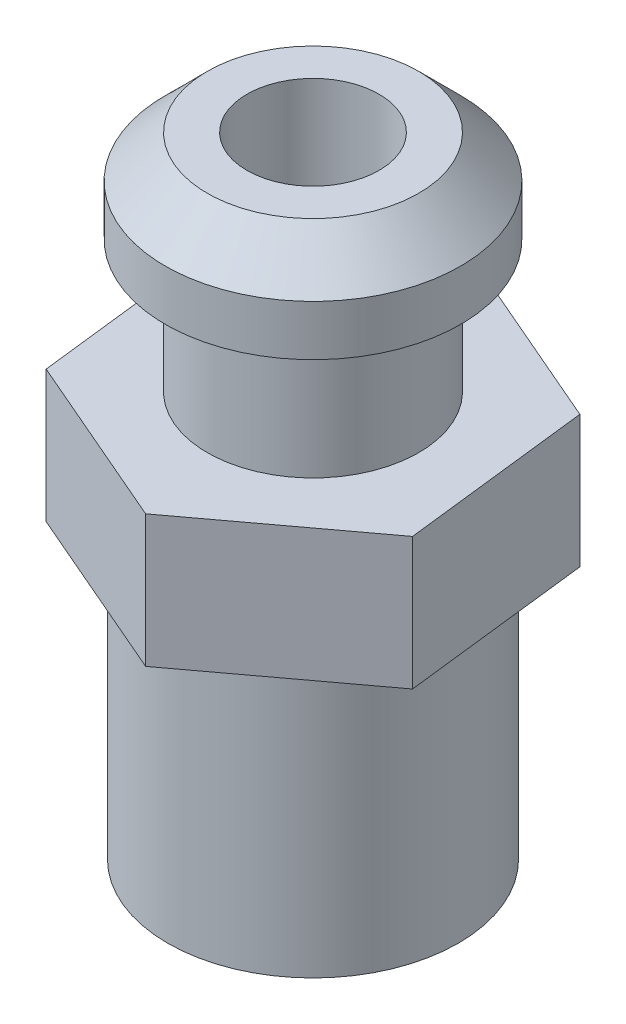
ISO-10303-21;
HEADER;
FILE_DESCRIPTION(('STEP AP214'),'2;1');
FILE_NAME('part.step','',(''),(''),'','','');
FILE_SCHEMA(('AUTOMOTIVE_DESIGN { 1 0 10303 214 1 1 1 1 }'));
ENDSEC;
DATA;
#1=APPLICATION_CONTEXT('core data for automotive mechanical design processes');
#2=APPLICATION_PROTOCOL_DEFINITION('international standard','automotive_design',2000,#1);
#3=PRODUCT_CONTEXT('',#1,'mechanical');
#4=PRODUCT('Part','Part','',(#3));
#5=PRODUCT_RELATED_PRODUCT_CATEGORY('part','',(#4));
#6=PRODUCT_DEFINITION_FORMATION('','',#4);
#7=PRODUCT_DEFINITION_CONTEXT('part definition',#1,'design');
#8=PRODUCT_DEFINITION('design','',#6,#7);
#9=PRODUCT_DEFINITION_SHAPE('','',#8);
#10=(LENGTH_UNIT() NAMED_UNIT(*) SI_UNIT(.MILLI.,.METRE.));
#11=(NAMED_UNIT(*) PLANE_ANGLE_UNIT() SI_UNIT($,.RADIAN.));
#12=(NAMED_UNIT(*) SI_UNIT($,.STERADIAN.) SOLID_ANGLE_UNIT());
#13=UNCERTAINTY_MEASURE_WITH_UNIT(LENGTH_MEASURE(1.E-05),#10,'distance_accuracy_value','');
#14=(GEOMETRIC_REPRESENTATION_CONTEXT(3) GLOBAL_UNCERTAINTY_ASSIGNED_CONTEXT((#13)) GLOBAL_UNIT_ASSIGNED_CONTEXT((#10,
#11,#12)) REPRESENTATION_CONTEXT('',''));
#15=CARTESIAN_POINT('',(0.,0.,0.));
#16=DIRECTION('',(0.,0.,1.));
#17=DIRECTION('',(1.,0.,0.));
#18=AXIS2_PLACEMENT_3D('',#15,#16,#17);
#19=CARTESIAN_POINT('',(0.,9.398,0.));
#20=DIRECTION('',(0.,-1.,0.));
#21=DIRECTION('',(0.,0.,-1.));
#22=AXIS2_PLACEMENT_3D('',#19,#20,#21);
#23=PLANE('',#22);
#24=CARTESIAN_POINT('',(0.,9.398,0.));
#25=DIRECTION('',(0.,-1.,0.));
#26=DIRECTION('',(0.,0.,-1.));
#27=AXIS2_PLACEMENT_3D('',#24,#25,#26);
#28=CIRCLE('',#27,2.032);
#29=CARTESIAN_POINT('',(0.,9.398,-2.032));
#30=VERTEX_POINT('',#29);
#31=EDGE_CURVE('E12',#30,#30,#28,.T.);
#32=ORIENTED_EDGE('',*,*,#31,.T.);
#33=EDGE_LOOP('',(#32));
#34=FACE_BOUND('',#33,.T.);
#35=DIRECTION('',(0.802257150251262,0.,-0.596978613411505));
#36=VECTOR('',#35,1.);
#37=CARTESIAN_POINT('',(0.424799860820971,9.398,3.64148025006038));
#38=LINE('',#37,#36);
#39=CARTESIAN_POINT('',(0.424799860820971,9.398,3.64148025006038));
#40=VERTEX_POINT('',#39);
#41=CARTESIAN_POINT('',(3.36601433434208,9.398,1.45285265403514));
#42=VERTEX_POINT('',#41);
#43=EDGE_CURVE('E127',#40,#42,#38,.T.);
#44=ORIENTED_EDGE('',*,*,#43,.T.);
#45=DIRECTION('',(-0.115870069604742,0.,-0.993264379191055));
#46=VECTOR('',#45,1.);
#47=CARTESIAN_POINT('',(3.36601433434208,9.398,1.45285265403514));
#48=LINE('',#47,#46);
#49=CARTESIAN_POINT('',(2.94121447352111,9.398,-2.18862759602525));
#50=VERTEX_POINT('',#49);
#51=EDGE_CURVE('E130',#42,#50,#48,.T.);
#52=ORIENTED_EDGE('',*,*,#51,.T.);
#53=DIRECTION('',(-0.918127219856004,0.,-0.39628576577955));
#54=VECTOR('',#53,1.);
#55=CARTESIAN_POINT('',(2.94121447352111,9.398,-2.18862759602525));
#56=LINE('',#55,#54);
#57=CARTESIAN_POINT('',(-0.424799860820973,9.398,-3.64148025006038));
#58=VERTEX_POINT('',#57);
#59=EDGE_CURVE('E64',#50,#58,#56,.T.);
#60=ORIENTED_EDGE('',*,*,#59,.T.);
#61=DIRECTION('',(-0.802257150251262,0.,0.596978613411505));
#62=VECTOR('',#61,1.);
#63=CARTESIAN_POINT('',(-0.424799860820973,9.398,-3.64148025006038));
#64=LINE('',#63,#62);
#65=CARTESIAN_POINT('',(-3.36601433434209,9.398,-1.45285265403513));
#66=VERTEX_POINT('',#65);
#67=EDGE_CURVE('E104',#58,#66,#64,.T.);
#68=ORIENTED_EDGE('',*,*,#67,.T.);
#69=DIRECTION('',(0.115870069604742,0.,0.993264379191055));
#70=VECTOR('',#69,1.);
#71=CARTESIAN_POINT('',(-3.36601433434209,9.398,-1.45285265403513));
#72=LINE('',#71,#70);
#73=CARTESIAN_POINT('',(-2.94121447352111,9.398,2.18862759602525));
#74=VERTEX_POINT('',#73);
#75=EDGE_CURVE('E136',#66,#74,#72,.T.);
#76=ORIENTED_EDGE('',*,*,#75,.T.);
#77=DIRECTION('',(0.918127219856004,0.,0.39628576577955));
#78=VECTOR('',#77,1.);
#79=CARTESIAN_POINT('',(-2.94121447352111,9.398,2.18862759602525));
#80=LINE('',#79,#78);
#81=EDGE_CURVE('E139',#74,#40,#80,.T.);
#82=ORIENTED_EDGE('',*,*,#81,.T.);
#83=EDGE_LOOP('',(#44,#52,#60,#68,#76,#82));
#84=FACE_BOUND('',#83,.T.);
#85=ADVANCED_FACE('F36',(#34,#84),#23,.F.);
#86=CARTESIAN_POINT('',(0.,0.,0.));
#87=DIRECTION('',(0.,-1.,0.));
#88=DIRECTION('',(0.,0.,-1.));
#89=AXIS2_PLACEMENT_3D('',#86,#87,#88);
#90=CYLINDRICAL_SURFACE('',#89,2.032);
#91=ORIENTED_EDGE('',*,*,#31,.F.);
#92=EDGE_LOOP('',(#91));
#93=FACE_BOUND('',#92,.T.);
#94=CARTESIAN_POINT('',(0.,11.938,0.));
#95=DIRECTION('',(0.,-1.,0.));
#96=DIRECTION('',(0.,0.,-1.));
#97=AXIS2_PLACEMENT_3D('',#94,#95,#96);
#98=CIRCLE('',#97,2.032);
#99=CARTESIAN_POINT('',(0.,11.938,-2.032));
#100=VERTEX_POINT('',#99);
#101=EDGE_CURVE('E49',#100,#100,#98,.T.);
#102=ORIENTED_EDGE('',*,*,#101,.T.);
#103=EDGE_LOOP('',(#102));
#104=FACE_BOUND('',#103,.T.);
#105=ADVANCED_FACE('F167',(#93,#104),#90,.T.);
#106=CARTESIAN_POINT('',(0.,11.938,0.));
#107=DIRECTION('',(0.,1.,0.));
#108=DIRECTION('',(0.,0.,1.));
#109=AXIS2_PLACEMENT_3D('',#106,#107,#108);
#110=PLANE('',#109);
#111=ORIENTED_EDGE('',*,*,#101,.F.);
#112=EDGE_LOOP('',(#111));
#113=FACE_BOUND('',#112,.T.);
#114=CARTESIAN_POINT('',(0.,11.938,0.));
#115=DIRECTION('',(0.,-1.,0.));
#116=DIRECTION('',(0.,0.,-1.));
#117=AXIS2_PLACEMENT_3D('',#114,#115,#116);
#118=CIRCLE('',#117,2.83975744436022);
#119=CARTESIAN_POINT('',(0.,11.938,-2.83975744436022));
#120=VERTEX_POINT('',#119);
#121=EDGE_CURVE('E161',#120,#120,#118,.T.);
#122=ORIENTED_EDGE('',*,*,#121,.T.);
#123=EDGE_LOOP('',(#122));
#124=FACE_BOUND('',#123,.T.);
#125=ADVANCED_FACE('F169',(#113,#124),#110,.F.);
#126=CARTESIAN_POINT('',(0.,0.,0.));
#127=DIRECTION('',(0.,-1.,0.));
#128=DIRECTION('',(0.,0.,-1.));
#129=AXIS2_PLACEMENT_3D('',#126,#127,#128);
#130=CYLINDRICAL_SURFACE('',#129,2.83975744436022);
#131=ORIENTED_EDGE('',*,*,#121,.F.);
#132=EDGE_LOOP('',(#131));
#133=FACE_BOUND('',#132,.T.);
#134=CARTESIAN_POINT('',(0.,12.9082425556398,0.));
#135=DIRECTION('',(0.,-1.,0.));
#136=DIRECTION('',(0.,0.,-1.));
#137=AXIS2_PLACEMENT_3D('',#134,#135,#136);
#138=CIRCLE('',#137,2.83975744436022);
#139=CARTESIAN_POINT('',(0.,12.9082425556398,-2.83975744436022));
#140=VERTEX_POINT('',#139);
#141=EDGE_CURVE('E158',#140,#140,#138,.T.);
#142=ORIENTED_EDGE('',*,*,#141,.T.);
#143=EDGE_LOOP('',(#142));
#144=FACE_BOUND('',#143,.T.);
#145=ADVANCED_FACE('F172',(#133,#144),#130,.T.);
#146=CARTESIAN_POINT('',(0.,13.716,0.));
#147=DIRECTION('',(0.,-1.,0.));
#148=DIRECTION('',(0.,0.,-1.));
#149=AXIS2_PLACEMENT_3D('',#146,#147,#148);
#150=CONICAL_SURFACE('',#149,2.032,0.785398163397446);
#151=ORIENTED_EDGE('',*,*,#141,.F.);
#152=EDGE_LOOP('',(#151));
#153=FACE_BOUND('',#152,.T.);
#154=CARTESIAN_POINT('',(0.,13.716,0.));
#155=DIRECTION('',(0.,-1.,0.));
#156=DIRECTION('',(0.,0.,-1.));
#157=AXIS2_PLACEMENT_3D('',#154,#155,#156);
#158=CIRCLE('',#157,2.032);
#159=CARTESIAN_POINT('',(0.,13.716,-2.032));
#160=VERTEX_POINT('',#159);
#161=EDGE_CURVE('E155',#160,#160,#158,.T.);
#162=ORIENTED_EDGE('',*,*,#161,.T.);
#163=EDGE_LOOP('',(#162));
#164=FACE_BOUND('',#163,.T.);
#165=ADVANCED_FACE('F178',(#153,#164),#150,.T.);
#166=CARTESIAN_POINT('',(0.,13.716,0.));
#167=DIRECTION('',(0.,-1.,0.));
#168=DIRECTION('',(0.,0.,-1.));
#169=AXIS2_PLACEMENT_3D('',#166,#167,#168);
#170=PLANE('',#169);
#171=CARTESIAN_POINT('',(0.,13.716,0.));
#172=DIRECTION('',(0.,1.,0.));
#173=DIRECTION('',(0.,0.,1.));
#174=AXIS2_PLACEMENT_3D('',#171,#172,#173);
#175=CIRCLE('',#174,1.27);
#176=CARTESIAN_POINT('',(0.,13.716,1.27));
#177=VERTEX_POINT('',#176);
#178=EDGE_CURVE('E215',#177,#177,#175,.T.);
#179=ORIENTED_EDGE('',*,*,#178,.F.);
#180=EDGE_LOOP('',(#179));
#181=FACE_BOUND('',#180,.T.);
#182=ORIENTED_EDGE('',*,*,#161,.F.);
#183=EDGE_LOOP('',(#182));
#184=FACE_BOUND('',#183,.T.);
#185=ADVANCED_FACE('F184',(#181,#184),#170,.F.);
#186=CARTESIAN_POINT('',(0.424799860820971,6.858,3.64148025006038));
#187=DIRECTION('',(0.596978613411505,0.,0.802257150251262));
#188=DIRECTION('',(0.802257150251262,0.,-0.596978613411505));
#189=AXIS2_PLACEMENT_3D('',#186,#187,#188);
#190=PLANE('',#189);
#191=ORIENTED_EDGE('',*,*,#43,.F.);
#192=DIRECTION('',(0.,1.,0.));
#193=VECTOR('',#192,1.);
#194=CARTESIAN_POINT('',(0.424799860820971,6.858,3.64148025006038));
#195=LINE('',#194,#193);
#196=CARTESIAN_POINT('',(0.424799860820971,6.858,3.64148025006038));
#197=VERTEX_POINT('',#196);
#198=EDGE_CURVE('E142',#197,#40,#195,.T.);
#199=ORIENTED_EDGE('',*,*,#198,.F.);
#200=DIRECTION('',(0.802257150251262,0.,-0.596978613411505));
#201=VECTOR('',#200,1.);
#202=CARTESIAN_POINT('',(0.424799860820971,6.858,3.64148025006038));
#203=LINE('',#202,#201);
#204=CARTESIAN_POINT('',(3.36601433434208,6.858,1.45285265403514));
#205=VERTEX_POINT('',#204);
#206=EDGE_CURVE('E56',#197,#205,#203,.T.);
#207=ORIENTED_EDGE('',*,*,#206,.T.);
#208=DIRECTION('',(0.,1.,0.));
#209=VECTOR('',#208,1.);
#210=CARTESIAN_POINT('',(3.36601433434208,6.858,1.45285265403514));
#211=LINE('',#210,#209);
#212=EDGE_CURVE('E126',#205,#42,#211,.T.);
#213=ORIENTED_EDGE('',*,*,#212,.T.);
#214=EDGE_LOOP('',(#191,#199,#207,#213));
#215=FACE_BOUND('',#214,.T.);
#216=ADVANCED_FACE('F189',(#215),#190,.T.);
#217=CARTESIAN_POINT('',(-2.94121447352111,6.858,2.18862759602525));
#218=DIRECTION('',(-0.39628576577955,0.,0.918127219856004));
#219=DIRECTION('',(0.918127219856004,0.,0.39628576577955));
#220=AXIS2_PLACEMENT_3D('',#217,#218,#219);
#221=PLANE('',#220);
#222=ORIENTED_EDGE('',*,*,#81,.F.);
#223=DIRECTION('',(0.,1.,0.));
#224=VECTOR('',#223,1.);
#225=CARTESIAN_POINT('',(-2.94121447352111,6.858,2.18862759602525));
#226=LINE('',#225,#224);
#227=CARTESIAN_POINT('',(-2.94121447352111,6.858,2.18862759602525));
#228=VERTEX_POINT('',#227);
#229=EDGE_CURVE('E145',#228,#74,#226,.T.);
#230=ORIENTED_EDGE('',*,*,#229,.F.);
#231=DIRECTION('',(0.918127219856004,0.,0.39628576577955));
#232=VECTOR('',#231,1.);
#233=CARTESIAN_POINT('',(-2.94121447352111,6.858,2.18862759602525));
#234=LINE('',#233,#232);
#235=EDGE_CURVE('E120',#228,#197,#234,.T.);
#236=ORIENTED_EDGE('',*,*,#235,.T.);
#237=ORIENTED_EDGE('',*,*,#198,.T.);
#238=EDGE_LOOP('',(#222,#230,#236,#237));
#239=FACE_BOUND('',#238,.T.);
#240=ADVANCED_FACE('F195',(#239),#221,.T.);
#241=CARTESIAN_POINT('',(-3.36601433434209,6.858,-1.45285265403513));
#242=DIRECTION('',(-0.993264379191055,0.,0.115870069604742));
#243=DIRECTION('',(0.115870069604742,0.,0.993264379191055));
#244=AXIS2_PLACEMENT_3D('',#241,#242,#243);
#245=PLANE('',#244);
#246=ORIENTED_EDGE('',*,*,#75,.F.);
#247=DIRECTION('',(0.,1.,0.));
#248=VECTOR('',#247,1.);
#249=CARTESIAN_POINT('',(-3.36601433434209,6.858,-1.45285265403513));
#250=LINE('',#249,#248);
#251=CARTESIAN_POINT('',(-3.36601433434209,6.858,-1.45285265403513));
#252=VERTEX_POINT('',#251);
#253=EDGE_CURVE('E105',#252,#66,#250,.T.);
#254=ORIENTED_EDGE('',*,*,#253,.F.);
#255=DIRECTION('',(0.115870069604742,0.,0.993264379191055));
#256=VECTOR('',#255,1.);
#257=CARTESIAN_POINT('',(-3.36601433434209,6.858,-1.45285265403513));
#258=LINE('',#257,#256);
#259=EDGE_CURVE('E118',#252,#228,#258,.T.);
#260=ORIENTED_EDGE('',*,*,#259,.T.);
#261=ORIENTED_EDGE('',*,*,#229,.T.);
#262=EDGE_LOOP('',(#246,#254,#260,#261));
#263=FACE_BOUND('',#262,.T.);
#264=ADVANCED_FACE('F243',(#263),#245,.T.);
#265=CARTESIAN_POINT('',(-0.424799860820973,6.858,-3.64148025006038));
#266=DIRECTION('',(-0.596978613411505,0.,-0.802257150251262));
#267=DIRECTION('',(-0.802257150251262,0.,0.596978613411505));
#268=AXIS2_PLACEMENT_3D('',#265,#266,#267);
#269=PLANE('',#268);
#270=ORIENTED_EDGE('',*,*,#67,.F.);
#271=DIRECTION('',(0.,1.,0.));
#272=VECTOR('',#271,1.);
#273=CARTESIAN_POINT('',(-0.424799860820973,6.858,-3.64148025006038));
#274=LINE('',#273,#272);
#275=CARTESIAN_POINT('',(-0.424799860820973,6.858,-3.64148025006038));
#276=VERTEX_POINT('',#275);
#277=EDGE_CURVE('E97',#276,#58,#274,.T.);
#278=ORIENTED_EDGE('',*,*,#277,.F.);
#279=DIRECTION('',(-0.802257150251262,0.,0.596978613411505));
#280=VECTOR('',#279,1.);
#281=CARTESIAN_POINT('',(-0.424799860820973,6.858,-3.64148025006038));
#282=LINE('',#281,#280);
#283=EDGE_CURVE('E101',#276,#252,#282,.T.);
#284=ORIENTED_EDGE('',*,*,#283,.T.);
#285=ORIENTED_EDGE('',*,*,#253,.T.);
#286=EDGE_LOOP('',(#270,#278,#284,#285));
#287=FACE_BOUND('',#286,.T.);
#288=ADVANCED_FACE('F99',(#287),#269,.T.);
#289=CARTESIAN_POINT('',(2.94121447352111,6.858,-2.18862759602525));
#290=DIRECTION('',(0.39628576577955,0.,-0.918127219856004));
#291=DIRECTION('',(-0.918127219856004,0.,-0.39628576577955));
#292=AXIS2_PLACEMENT_3D('',#289,#290,#291);
#293=PLANE('',#292);
#294=ORIENTED_EDGE('',*,*,#59,.F.);
#295=DIRECTION('',(0.,1.,0.));
#296=VECTOR('',#295,1.);
#297=CARTESIAN_POINT('',(2.94121447352111,6.858,-2.18862759602525));
#298=LINE('',#297,#296);
#299=CARTESIAN_POINT('',(2.94121447352111,6.858,-2.18862759602525));
#300=VERTEX_POINT('',#299);
#301=EDGE_CURVE('E106',#300,#50,#298,.T.);
#302=ORIENTED_EDGE('',*,*,#301,.F.);
#303=DIRECTION('',(-0.918127219856004,0.,-0.39628576577955));
#304=VECTOR('',#303,1.);
#305=CARTESIAN_POINT('',(2.94121447352111,6.858,-2.18862759602525));
#306=LINE('',#305,#304);
#307=EDGE_CURVE('E109',#300,#276,#306,.T.);
#308=ORIENTED_EDGE('',*,*,#307,.T.);
#309=ORIENTED_EDGE('',*,*,#277,.T.);
#310=EDGE_LOOP('',(#294,#302,#308,#309));
#311=FACE_BOUND('',#310,.T.);
#312=ADVANCED_FACE('F110',(#311),#293,.T.);
#313=CARTESIAN_POINT('',(3.36601433434208,6.858,1.45285265403514));
#314=DIRECTION('',(0.993264379191055,0.,-0.115870069604742));
#315=DIRECTION('',(-0.115870069604742,0.,-0.993264379191055));
#316=AXIS2_PLACEMENT_3D('',#313,#314,#315);
#317=PLANE('',#316);
#318=ORIENTED_EDGE('',*,*,#51,.F.);
#319=ORIENTED_EDGE('',*,*,#212,.F.);
#320=DIRECTION('',(-0.115870069604742,0.,-0.993264379191055));
#321=VECTOR('',#320,1.);
#322=CARTESIAN_POINT('',(3.36601433434208,6.858,1.45285265403514));
#323=LINE('',#322,#321);
#324=EDGE_CURVE('E114',#205,#300,#323,.T.);
#325=ORIENTED_EDGE('',*,*,#324,.T.);
#326=ORIENTED_EDGE('',*,*,#301,.T.);
#327=EDGE_LOOP('',(#318,#319,#325,#326));
#328=FACE_BOUND('',#327,.T.);
#329=ADVANCED_FACE('F212',(#328),#317,.T.);
#330=CARTESIAN_POINT('',(0.,0.,0.));
#331=DIRECTION('',(0.,1.,0.));
#332=DIRECTION('',(0.,0.,1.));
#333=AXIS2_PLACEMENT_3D('',#330,#331,#332);
#334=CONICAL_SURFACE('',#333,0.,1.0471975511966);
#335=CARTESIAN_POINT('',(0.,1.61311665211581,0.));
#336=DIRECTION('',(0.,-1.,0.));
#337=DIRECTION('',(0.,0.,-1.));
#338=AXIS2_PLACEMENT_3D('',#335,#336,#337);
#339=CIRCLE('',#338,2.794);
#340=CARTESIAN_POINT('',(0.,1.61311665211581,-2.794));
#341=VERTEX_POINT('',#340);
#342=EDGE_CURVE('E152',#341,#341,#339,.T.);
#343=ORIENTED_EDGE('',*,*,#342,.T.);
#344=EDGE_LOOP('',(#343));
#345=FACE_BOUND('',#344,.T.);
#346=CARTESIAN_POINT('',(0.,0.,0.));
#347=VERTEX_POINT('',#346);
#348=VERTEX_LOOP('',#347);
#349=FACE_BOUND('',#348,.T.);
#350=ADVANCED_FACE('F253',(#345,#349),#334,.T.);
#351=CARTESIAN_POINT('',(0.,0.,0.));
#352=DIRECTION('',(0.,-1.,0.));
#353=DIRECTION('',(0.,0.,-1.));
#354=AXIS2_PLACEMENT_3D('',#351,#352,#353);
#355=CYLINDRICAL_SURFACE('',#354,2.794);
#356=CARTESIAN_POINT('',(-2.72088423127483,3.79195235957136,-0.635));
#357=CARTESIAN_POINT('',(-2.72088493970861,3.82712277206635,-0.63499883982767));
#358=CARTESIAN_POINT('',(-2.72157358896207,3.86230682446334,-0.632068109332914));
#359=CARTESIAN_POINT('',(-2.72424820928516,3.93167180961575,-0.620436961405991));
#360=CARTESIAN_POINT('',(-2.72623507013706,3.96585203755716,-0.611732586709162));
#361=CARTESIAN_POINT('',(-2.73126973326066,4.03219598840524,-0.588844492556458));
#362=CARTESIAN_POINT('',(-2.73431631785342,4.06436197593782,-0.574667059890661));
#363=CARTESIAN_POINT('',(-2.74112567747865,4.12586035308853,-0.541253616476163));
#364=CARTESIAN_POINT('',(-2.74488844975095,4.15519275362662,-0.522017625222984));
#365=CARTESIAN_POINT('',(-2.75278286224879,4.21072609171308,-0.478659261211028));
#366=CARTESIAN_POINT('',(-2.75691953604857,4.23686784779577,-0.454461991811337));
#367=CARTESIAN_POINT('',(-2.76505169331145,4.28475871586895,-0.402029538985921));
#368=CARTESIAN_POINT('',(-2.76904716522579,4.30650746924349,-0.373794026225574));
#369=CARTESIAN_POINT('',(-2.77650179015189,4.3452311738325,-0.313687514062456));
#370=CARTESIAN_POINT('',(-2.77995431050126,4.36214888248076,-0.281778742577742));
#371=CARTESIAN_POINT('',(-2.7858770200949,4.39035944784827,-0.215479339331659));
#372=CARTESIAN_POINT('',(-2.7883473285194,4.40165298703847,-0.18108900927783));
#373=CARTESIAN_POINT('',(-2.79199170349128,4.41810759589156,-0.111418520849939));
#374=CARTESIAN_POINT('',(-2.79318693788915,4.42336892182016,-0.0761631668259644));
#375=CARTESIAN_POINT('',(-2.79421994569391,4.42792353697398,-0.00525131259642495));
#376=CARTESIAN_POINT('',(-2.79405788624394,4.4272175610389,0.0304051376763454));
#377=CARTESIAN_POINT('',(-2.79241063430897,4.4199316145137,0.100414803211659));
#378=CARTESIAN_POINT('',(-2.79094979300767,4.41345974545586,0.134779926432631));
#379=CARTESIAN_POINT('',(-2.78689701724004,4.39499837733989,0.201923149914224));
#380=CARTESIAN_POINT('',(-2.78430502904167,4.38300861616785,0.234701174701875));
#381=CARTESIAN_POINT('',(-2.7782425304481,4.35375834546511,0.298035838714238));
#382=CARTESIAN_POINT('',(-2.77476533603011,4.33645751878447,0.32857319197424));
#383=CARTESIAN_POINT('',(-2.76731265551087,4.29710641353456,0.386350255889804));
#384=CARTESIAN_POINT('',(-2.76333709655407,4.27505544020554,0.413589483247849));
#385=CARTESIAN_POINT('',(-2.75521854508754,4.22624373999288,0.464640560245481));
#386=CARTESIAN_POINT('',(-2.75107379729736,4.19938842282806,0.488361774045336));
#387=CARTESIAN_POINT('',(-2.7431670827424,4.14203781237405,0.530981716985757));
#388=CARTESIAN_POINT('',(-2.73940512809999,4.11154240387613,0.549880293430617));
#389=CARTESIAN_POINT('',(-2.73268482650064,4.04762266659148,0.5823632939397));
#390=CARTESIAN_POINT('',(-2.72972926319851,4.01418870607573,0.595929379561286));
#391=CARTESIAN_POINT('',(-2.72499407315904,3.94543222692157,0.617222435680656));
#392=CARTESIAN_POINT('',(-2.72321424332246,3.91011003560115,0.624950414701232));
#393=CARTESIAN_POINT('',(-2.72107379128413,3.83941118066525,0.634204777291174));
#394=CARTESIAN_POINT('',(-2.72068285178382,3.80405275883667,0.63586366401332));
#395=CARTESIAN_POINT('',(-2.72128246672738,3.73356456470246,0.633292542698174));
#396=CARTESIAN_POINT('',(-2.7222729180468,3.69843477552547,0.629062974249595));
#397=CARTESIAN_POINT('',(-2.72549497403779,3.62987031294403,0.614950300860761));
#398=CARTESIAN_POINT('',(-2.72771031069875,3.59641956120268,0.605141250336459));
#399=CARTESIAN_POINT('',(-2.73311764859761,3.53163649909395,0.580228734222567));
#400=CARTESIAN_POINT('',(-2.73630974935129,3.50030440497938,0.565124729143564));
#401=CARTESIAN_POINT('',(-2.74337682805057,3.44007776765537,0.529762964081296));
#402=CARTESIAN_POINT('',(-2.74726221354449,3.41123202905497,0.509424205658762));
#403=CARTESIAN_POINT('',(-2.75525114292535,3.35731434054687,0.46427531776606));
#404=CARTESIAN_POINT('',(-2.7593547161215,3.33224289938361,0.439464586499086));
#405=CARTESIAN_POINT('',(-2.76741832661402,3.28606536067534,0.385474184122045));
#406=CARTESIAN_POINT('',(-2.77137376771442,3.26504995269228,0.356216141319725));
#407=CARTESIAN_POINT('',(-2.77860836219836,3.22823217273788,0.294508345776897));
#408=CARTESIAN_POINT('',(-2.7818875484112,3.21242954768571,0.262058748085839));
#409=CARTESIAN_POINT('',(-2.78738090884142,3.18660929515705,0.195098682526241));
#410=CARTESIAN_POINT('',(-2.78960210096306,3.17655345641203,0.160603551352808));
#411=CARTESIAN_POINT('',(-2.79275965676867,3.16239391654337,0.0903570159029494));
#412=CARTESIAN_POINT('',(-2.79369622296974,3.15828927722662,0.0546058105541577));
#413=CARTESIAN_POINT('',(-2.79417239749324,3.1561936320637,-0.016279531253053));
#414=CARTESIAN_POINT('',(-2.79374284756174,3.15806765363085,-0.051409537119443));
#415=CARTESIAN_POINT('',(-2.79160173609245,3.16757234053559,-0.120839938591257));
#416=CARTESIAN_POINT('',(-2.78989020126621,3.17520288592974,-0.155140351466785));
#417=CARTESIAN_POINT('',(-2.78538037859106,3.19593720393107,-0.221823796691584));
#418=CARTESIAN_POINT('',(-2.78258617104824,3.20902044062726,-0.254213508041373));
#419=CARTESIAN_POINT('',(-2.77620823771223,3.2402692431937,-0.316355262304507));
#420=CARTESIAN_POINT('',(-2.7726244288704,3.25843534372348,-0.346107027302071));
#421=CARTESIAN_POINT('',(-2.76496615239643,3.29976689859122,-0.402782100922167));
#422=CARTESIAN_POINT('',(-2.76088319524307,3.32302642783042,-0.42963566129285));
#423=CARTESIAN_POINT('',(-2.75273043547544,3.37369664802482,-0.479104528145644));
#424=CARTESIAN_POINT('',(-2.74866063631012,3.40110834942781,-0.501718799974233));
#425=CARTESIAN_POINT('',(-2.74092795161732,3.45978944600804,-0.542389078301808));
#426=CARTESIAN_POINT('',(-2.73727192384664,3.49110960666542,-0.560373224481109));
#427=CARTESIAN_POINT('',(-2.7308683610214,3.55640516781983,-0.590793935470075));
#428=CARTESIAN_POINT('',(-2.72812008501163,3.59037837461037,-0.603235027723795));
#429=CARTESIAN_POINT('',(-2.72433121387195,3.65229502076372,-0.62008997257176));
#430=CARTESIAN_POINT('',(-2.72304746265897,3.67991198740303,-0.625670143875215));
#431=CARTESIAN_POINT('',(-2.721323711887,3.73566719701302,-0.633125516416713));
#432=CARTESIAN_POINT('',(-2.72088366431389,3.76380541022818,-0.635000928488166));
#433=CARTESIAN_POINT('',(-2.72088423127483,3.79195235957136,-0.635));
#434=B_SPLINE_CURVE_WITH_KNOTS('',3,(#356,#357,#358,#359,#360,#361,#362,#363,#364,#365,#366,
#367,#368,#369,#370,#371,#372,#373,#374,#375,#376,#377,#378,#379,#380,#381,#382,#383,#384,#385,
#386,#387,#388,#389,#390,#391,#392,#393,#394,#395,#396,#397,#398,#399,#400,#401,#402,#403,#404,
#405,#406,#407,#408,#409,#410,#411,#412,#413,#414,#415,#416,#417,#418,#419,#420,#421,#422,#423,
#424,#425,#426,#427,#428,#429,#430,#431,#432,#433),.UNSPECIFIED.,.T.,.F.,(4,2,2,2,2,2,2,2,2,2,2,
2,2,2,2,2,2,2,2,2,2,2,2,2,2,2,2,2,2,2,2,2,2,2,2,2,2,2,4),(0.,0.10540802978821,0.210888381160002,
0.316247928208334,0.421607069210298,0.528692458650819,0.635786586311045,0.744101480405102,
0.852403227706189,0.95887763056664,1.06533892189351,1.16984527691482,1.27435659676625,
1.37968176394532,1.48502234652853,1.59272697732081,1.70043501786454,1.80851029194074,
1.91656689192885,2.02224977876495,2.12792477651778,2.2322288661657,2.33654358618142,
2.44258114721422,2.54863298847091,2.65683473197218,2.76503122150087,2.87249966551402,
2.97995116552793,3.08499418011738,3.19003500608175,3.29468375225201,3.39934351042262,
3.50612968122442,3.61294188074486,3.72132354680674,3.82961652610215,3.9139795779503,
3.99833782865989),.UNSPECIFIED.);
#435=CARTESIAN_POINT('',(-2.72088423127483,3.79195235957136,-0.635));
#436=VERTEX_POINT('',#435);
#437=EDGE_CURVE('E218',#436,#436,#434,.T.);
#438=ORIENTED_EDGE('',*,*,#437,.T.);
#439=EDGE_LOOP('',(#438));
#440=FACE_BOUND('',#439,.T.);
#441=ORIENTED_EDGE('',*,*,#342,.F.);
#442=EDGE_LOOP('',(#441));
#443=FACE_BOUND('',#442,.T.);
#444=CARTESIAN_POINT('',(0.,6.858,0.));
#445=DIRECTION('',(0.,-1.,0.));
#446=DIRECTION('',(0.,0.,-1.));
#447=AXIS2_PLACEMENT_3D('',#444,#445,#446);
#448=CIRCLE('',#447,2.794);
#449=CARTESIAN_POINT('',(0.,6.858,-2.794));
#450=VERTEX_POINT('',#449);
#451=EDGE_CURVE('E144',#450,#450,#448,.T.);
#452=ORIENTED_EDGE('',*,*,#451,.T.);
#453=EDGE_LOOP('',(#452));
#454=FACE_BOUND('',#453,.T.);
#455=ADVANCED_FACE('F225',(#440,#443,#454),#355,.T.);
#456=CARTESIAN_POINT('',(0.,6.858,0.));
#457=DIRECTION('',(0.,1.,0.));
#458=DIRECTION('',(0.,0.,1.));
#459=AXIS2_PLACEMENT_3D('',#456,#457,#458);
#460=PLANE('',#459);
#461=ORIENTED_EDGE('',*,*,#451,.F.);
#462=EDGE_LOOP('',(#461));
#463=FACE_BOUND('',#462,.T.);
#464=ORIENTED_EDGE('',*,*,#206,.F.);
#465=ORIENTED_EDGE('',*,*,#235,.F.);
#466=ORIENTED_EDGE('',*,*,#259,.F.);
#467=ORIENTED_EDGE('',*,*,#283,.F.);
#468=ORIENTED_EDGE('',*,*,#307,.F.);
#469=ORIENTED_EDGE('',*,*,#324,.F.);
#470=EDGE_LOOP('',(#464,#465,#466,#467,#468,#469));
#471=FACE_BOUND('',#470,.T.);
#472=ADVANCED_FACE('F38',(#463,#471),#460,.F.);
#473=CARTESIAN_POINT('',(0.,2.286,0.));
#474=DIRECTION('',(0.,1.,0.));
#475=DIRECTION('',(0.,0.,1.));
#476=AXIS2_PLACEMENT_3D('',#473,#474,#475);
#477=CYLINDRICAL_SURFACE('',#476,1.27);
#478=CARTESIAN_POINT('',(-1.09985226280624,3.79195235957136,-0.635));
#479=CARTESIAN_POINT('',(-1.09985514552572,3.75886390136737,-0.634997690552328));
#480=CARTESIAN_POINT('',(-1.10136813754225,3.72573366325295,-0.632396481415593));
#481=CARTESIAN_POINT('',(-1.10720102697053,3.66049004650137,-0.622124238285264));
#482=CARTESIAN_POINT('',(-1.1115268222528,3.62837895351879,-0.614442550991904));
#483=CARTESIAN_POINT('',(-1.12235835094428,3.56624055271296,-0.594423467424381));
#484=CARTESIAN_POINT('',(-1.12885247605515,3.53620315525063,-0.582110819833519));
#485=CARTESIAN_POINT('',(-1.14327092158705,3.47862799130344,-0.553254878613996));
#486=CARTESIAN_POINT('',(-1.15119531937301,3.4510903601547,-0.536711356112716));
#487=CARTESIAN_POINT('',(-1.16838011851475,3.39678822193734,-0.498263253237108));
#488=CARTESIAN_POINT('',(-1.177696804101,3.37027480841866,-0.476029042951295));
#489=CARTESIAN_POINT('',(-1.19616209068923,3.3211580329331,-0.427516167835187));
#490=CARTESIAN_POINT('',(-1.20531060582844,3.29855662133082,-0.401235497871756));
#491=CARTESIAN_POINT('',(-1.22314637865123,3.25641421859259,-0.343210872768237));
#492=CARTESIAN_POINT('',(-1.2317609757554,3.23718221698056,-0.311218065022985));
#493=CARTESIAN_POINT('',(-1.24682730123201,3.2044879177603,-0.243939711890685));
#494=CARTESIAN_POINT('',(-1.25328039401676,3.19102197892426,-0.208656261717729));
#495=CARTESIAN_POINT('',(-1.26289092890091,3.17123689964516,-0.138458539392995));
#496=CARTESIAN_POINT('',(-1.26625019940266,3.16447741033559,-0.103696636960399));
#497=CARTESIAN_POINT('',(-1.27004815742253,3.15684687421271,-0.0333823492231334));
#498=CARTESIAN_POINT('',(-1.27048861208215,3.15597226450608,0.00216954471077412));
#499=CARTESIAN_POINT('',(-1.26849493516946,3.15996649754253,0.0697436530090814));
#500=CARTESIAN_POINT('',(-1.26630744891522,3.16434249942733,0.101803961477263));
#501=CARTESIAN_POINT('',(-1.2596764573994,3.17783169545082,0.164664245168135));
#502=CARTESIAN_POINT('',(-1.2552327833216,3.18694524407126,0.195464125894643));
#503=CARTESIAN_POINT('',(-1.24441955387661,3.20970978903839,0.255466463646667));
#504=CARTESIAN_POINT('',(-1.23802420371041,3.22342181843562,0.284640923932138));
#505=CARTESIAN_POINT('',(-1.22388405201546,3.25490962885931,0.340345268960964));
#506=CARTESIAN_POINT('',(-1.21613876760002,3.27268686476835,0.36687420201254));
#507=CARTESIAN_POINT('',(-1.19916190443511,3.31373090779482,0.419210274670354));
#508=CARTESIAN_POINT('',(-1.18985903758841,3.33735778255837,0.444712137643644));
#509=CARTESIAN_POINT('',(-1.17128506272625,3.38846683490202,0.491556275139091));
#510=CARTESIAN_POINT('',(-1.16201398448674,3.41595195096539,0.512895349349637));
#511=CARTESIAN_POINT('',(-1.14391539118728,3.47613396176065,0.552135887497804));
#512=CARTESIAN_POINT('',(-1.13515343194099,3.50905098421078,0.569732995011063));
#513=CARTESIAN_POINT('',(-1.11998410926896,3.57791778088432,0.599007636755782));
#514=CARTESIAN_POINT('',(-1.11357429079253,3.61386434453751,0.610691347963915));
#515=CARTESIAN_POINT('',(-1.10454843743817,3.68477357423593,0.626859434000901));
#516=CARTESIAN_POINT('',(-1.10167201463795,3.71958847016401,0.631840952546185));
#517=CARTESIAN_POINT('',(-1.09929878794622,3.78966721143436,0.635963261098256));
#518=CARTESIAN_POINT('',(-1.09979959674713,3.82493072206242,0.635108176895042));
#519=CARTESIAN_POINT('',(-1.10384803703271,3.89079259786885,0.628037887523419));
#520=CARTESIAN_POINT('',(-1.10705638066725,3.92147931102489,0.622419263612417));
#521=CARTESIAN_POINT('',(-1.11565703685102,3.98141590385342,0.606867140741601));
#522=CARTESIAN_POINT('',(-1.12105005663196,4.01066531479545,0.596932244425995));
#523=CARTESIAN_POINT('',(-1.13370501020582,4.06843855469457,0.572546218764103));
#524=CARTESIAN_POINT('',(-1.14104193459345,4.09686603527336,0.55790723044488));
#525=CARTESIAN_POINT('',(-1.15669135880754,4.15102534699862,0.524692285650036));
#526=CARTESIAN_POINT('',(-1.16500435880519,4.17675578320229,0.506114306750957));
#527=CARTESIAN_POINT('',(-1.18292879019773,4.22818387694881,0.462811601171272));
#528=CARTESIAN_POINT('',(-1.19257180302974,4.25346855027707,0.437607247920004));
#529=CARTESIAN_POINT('',(-1.21116239210962,4.29957913069729,0.383161854577913));
#530=CARTESIAN_POINT('',(-1.22010973279895,4.32040353166775,0.353919456406145));
#531=CARTESIAN_POINT('',(-1.23660764673758,4.35746667554967,0.291169955224811));
#532=CARTESIAN_POINT('',(-1.24411512461739,4.37356988963529,0.257570666959561));
#533=CARTESIAN_POINT('',(-1.25655930399156,4.3997349285208,0.187656701547087));
#534=CARTESIAN_POINT('',(-1.26149826234497,4.40980205818896,0.151344440384032));
#535=CARTESIAN_POINT('',(-1.26788867695496,4.42274139782227,0.0806320982798148));
#536=CARTESIAN_POINT('',(-1.26961854221701,4.42618901075269,0.0463622668450401));
#537=CARTESIAN_POINT('',(-1.27026752788208,4.4274878331349,-0.0223050010790144));
#538=CARTESIAN_POINT('',(-1.26918763222475,4.42534100168382,-0.0567023886873801));
#539=CARTESIAN_POINT('',(-1.26450070212081,4.41589294125614,-0.122261625121388));
#540=CARTESIAN_POINT('',(-1.26106488114174,4.40894068029274,-0.153487321810152));
#541=CARTESIAN_POINT('',(-1.25216979476274,4.39054971501397,-0.214278179636597));
#542=CARTESIAN_POINT('',(-1.24671023919325,4.37911036731202,-0.243843101946748));
#543=CARTESIAN_POINT('',(-1.23396966025056,4.35156068144597,-0.301893862965502));
#544=CARTESIAN_POINT('',(-1.22662071921237,4.33527148933438,-0.33027946561453));
#545=CARTESIAN_POINT('',(-1.21086964545059,4.29870907347586,-0.384031897551906));
#546=CARTESIAN_POINT('',(-1.20246702964559,4.27843401988291,-0.409397331708466));
#547=CARTESIAN_POINT('',(-1.18445667493909,4.23213617629194,-0.459050392639626));
#548=CARTESIAN_POINT('',(-1.17481222372428,4.20574218002334,-0.482979529682438));
#549=CARTESIAN_POINT('',(-1.15610053363411,4.14917115165395,-0.526201187495619));
#550=CARTESIAN_POINT('',(-1.14703381058785,4.11899080832038,-0.545489606256388));
#551=CARTESIAN_POINT('',(-1.13029749368622,4.05443808899245,-0.579393735663891));
#552=CARTESIAN_POINT('',(-1.12268110652732,4.01996337730461,-0.593842516885197));
#553=CARTESIAN_POINT('',(-1.11040009268503,3.9485862828156,-0.616507980536572));
#554=CARTESIAN_POINT('',(-1.10572560253791,3.9116924751118,-0.624745506396345));
#555=CARTESIAN_POINT('',(-1.10191088102137,3.86065595873234,-0.631423049993903));
#556=CARTESIAN_POINT('',(-1.10114161918271,3.8469637466287,-0.632762326652045));
#557=CARTESIAN_POINT('',(-1.10011169288721,3.81950089433813,-0.634551312232127));
#558=CARTESIAN_POINT('',(-1.09985106245444,3.80573024896633,-0.635000961643918));
#559=CARTESIAN_POINT('',(-1.09985226280624,3.79195235957136,-0.635));
#560=B_SPLINE_CURVE_WITH_KNOTS('',3,(#478,#479,#480,#481,#482,#483,#484,#485,#486,#487,#488,
#489,#490,#491,#492,#493,#494,#495,#496,#497,#498,#499,#500,#501,#502,#503,#504,#505,#506,#507,
#508,#509,#510,#511,#512,#513,#514,#515,#516,#517,#518,#519,#520,#521,#522,#523,#524,#525,#526,
#527,#528,#529,#530,#531,#532,#533,#534,#535,#536,#537,#538,#539,#540,#541,#542,#543,#544,#545,
#546,#547,#548,#549,#550,#551,#552,#553,#554,#555,#556,#557,#558,#559),.UNSPECIFIED.,.T.,.F.,(4,
2,2,2,2,2,2,2,2,2,2,2,2,2,2,2,2,2,2,2,2,2,2,2,2,2,2,2,2,2,2,2,2,2,2,2,2,2,2,2,4),(0.,
0.0992073978476442,0.198623486943751,0.297515658408492,0.39641318065767,0.503467568436379,
0.610575176385756,0.724902615716148,0.839157751220708,0.945283129546389,1.05134425040635,
1.14818221902682,1.24502743448584,1.34321254554278,1.44143285087423,1.54893766575126,
1.65652480636158,1.770944144982,1.88524371624433,1.99048554692425,2.09565299174617,
2.18931606474256,2.283009482969,2.38104233217866,2.4791256374973,2.58957282173689,
2.70005724261158,2.81345755197233,2.9267580517857,3.02966291697324,3.13253175114172,
3.22862209793398,3.32472622780128,3.42494076706865,3.52520142113957,3.63544003574793,
3.74577573706673,3.85959825639514,3.97303709456753,4.01434385842671,4.05565338534033),.UNSPECIFIED.);
#561=CARTESIAN_POINT('',(-1.09985226280624,3.79195235957136,-0.635));
#562=VERTEX_POINT('',#561);
#563=EDGE_CURVE('E40',#562,#562,#560,.T.);
#564=ORIENTED_EDGE('',*,*,#563,.T.);
#565=EDGE_LOOP('',(#564));
#566=FACE_BOUND('',#565,.T.);
#567=CARTESIAN_POINT('',(0.,2.286,0.));
#568=DIRECTION('',(0.,1.,0.));
#569=DIRECTION('',(0.,0.,1.));
#570=AXIS2_PLACEMENT_3D('',#567,#568,#569);
#571=CIRCLE('',#570,1.27);
#572=CARTESIAN_POINT('',(0.,2.286,1.27));
#573=VERTEX_POINT('',#572);
#574=EDGE_CURVE('E131',#573,#573,#571,.T.);
#575=ORIENTED_EDGE('',*,*,#574,.F.);
#576=EDGE_LOOP('',(#575));
#577=FACE_BOUND('',#576,.T.);
#578=ORIENTED_EDGE('',*,*,#178,.T.);
#579=EDGE_LOOP('',(#578));
#580=FACE_BOUND('',#579,.T.);
#581=ADVANCED_FACE('F235',(#566,#577,#580),#477,.F.);
#582=CARTESIAN_POINT('',(0.,2.286,0.));
#583=DIRECTION('',(0.,1.,0.));
#584=DIRECTION('',(0.,0.,1.));
#585=AXIS2_PLACEMENT_3D('',#582,#583,#584);
#586=PLANE('',#585);
#587=ORIENTED_EDGE('',*,*,#574,.T.);
#588=EDGE_LOOP('',(#587));
#589=FACE_BOUND('',#588,.T.);
#590=ADVANCED_FACE('F231',(#589),#586,.T.);
#591=CARTESIAN_POINT('',(-11.43,3.79195235957136,0.));
#592=DIRECTION('',(1.,0.,0.));
#593=DIRECTION('',(0.,0.,-1.));
#594=AXIS2_PLACEMENT_3D('',#591,#592,#593);
#595=CYLINDRICAL_SURFACE('',#594,0.635);
#596=ORIENTED_EDGE('',*,*,#563,.F.);
#597=EDGE_LOOP('',(#596));
#598=FACE_BOUND('',#597,.T.);
#599=ORIENTED_EDGE('',*,*,#437,.F.);
#600=EDGE_LOOP('',(#599));
#601=FACE_BOUND('',#600,.T.);
#602=ADVANCED_FACE('F227',(#598,#601),#595,.F.);
#603=CLOSED_SHELL('',(#85,#105,#125,#145,#165,#185,#216,#240,#264,#288,#312,#329,#350,#455,#472,
#581,#590,#602));
#604=MANIFOLD_SOLID_BREP('B2',#603);
#605=ADVANCED_BREP_SHAPE_REPRESENTATION('',(#18,#604),#14);
#606=SHAPE_DEFINITION_REPRESENTATION(#9,#605);
ENDSEC;
END-ISO-10303-21;
